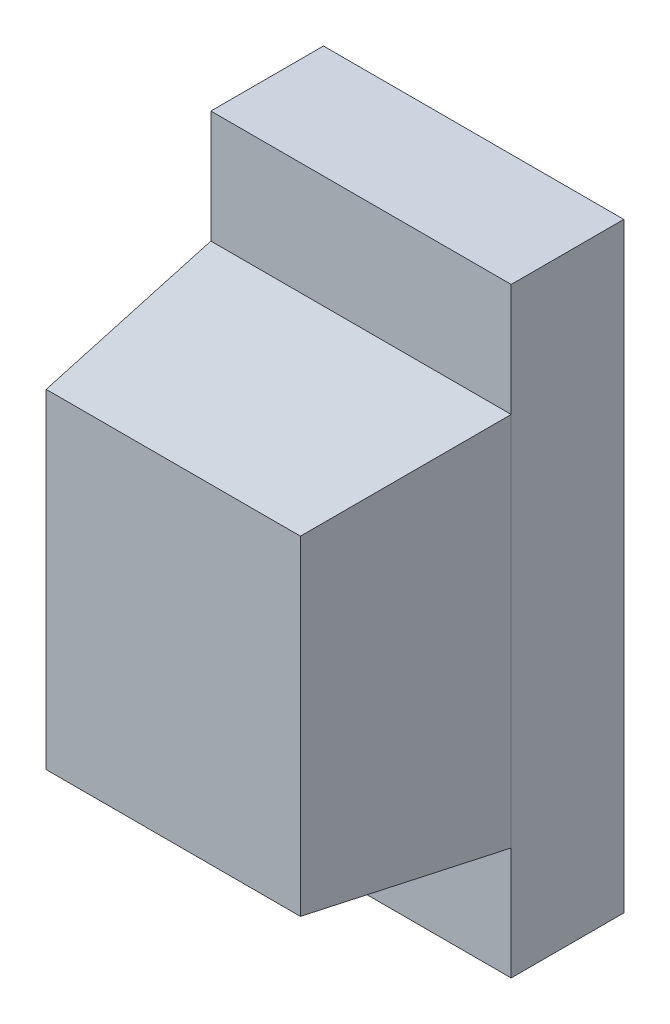
ISO-10303-21;
HEADER;
FILE_DESCRIPTION(('STEP AP214'),'2;1');
FILE_NAME('part.step','',(''),(''),'','','');
FILE_SCHEMA(('AUTOMOTIVE_DESIGN { 1 0 10303 214 1 1 1 1 }'));
ENDSEC;
DATA;
#1=APPLICATION_CONTEXT('core data for automotive mechanical design processes');
#2=APPLICATION_PROTOCOL_DEFINITION('international standard','automotive_design',2000,#1);
#3=PRODUCT_CONTEXT('',#1,'mechanical');
#4=PRODUCT('Part','Part','',(#3));
#5=PRODUCT_RELATED_PRODUCT_CATEGORY('part','',(#4));
#6=PRODUCT_DEFINITION_FORMATION('','',#4);
#7=PRODUCT_DEFINITION_CONTEXT('part definition',#1,'design');
#8=PRODUCT_DEFINITION('design','',#6,#7);
#9=PRODUCT_DEFINITION_SHAPE('','',#8);
#10=(LENGTH_UNIT() NAMED_UNIT(*) SI_UNIT(.MILLI.,.METRE.));
#11=(NAMED_UNIT(*) PLANE_ANGLE_UNIT() SI_UNIT($,.RADIAN.));
#12=(NAMED_UNIT(*) SI_UNIT($,.STERADIAN.) SOLID_ANGLE_UNIT());
#13=UNCERTAINTY_MEASURE_WITH_UNIT(LENGTH_MEASURE(1.E-05),#10,'distance_accuracy_value','');
#14=(GEOMETRIC_REPRESENTATION_CONTEXT(3) GLOBAL_UNCERTAINTY_ASSIGNED_CONTEXT((#13)) GLOBAL_UNIT_ASSIGNED_CONTEXT((#10,
#11,#12)) REPRESENTATION_CONTEXT('',''));
#15=CARTESIAN_POINT('',(0.,0.,0.));
#16=DIRECTION('',(0.,0.,1.));
#17=DIRECTION('',(1.,0.,0.));
#18=AXIS2_PLACEMENT_3D('',#15,#16,#17);
#19=CARTESIAN_POINT('',(0.,0.,0.3));
#20=DIRECTION('',(0.,0.,1.));
#21=DIRECTION('',(1.,0.,0.));
#22=AXIS2_PLACEMENT_3D('',#19,#20,#21);
#23=PLANE('',#22);
#24=DIRECTION('',(1.,0.,0.));
#25=VECTOR('',#24,1.);
#26=CARTESIAN_POINT('',(-0.4,-0.5,0.3));
#27=LINE('',#26,#25);
#28=CARTESIAN_POINT('',(-0.4,-0.5,0.3));
#29=VERTEX_POINT('',#28);
#30=CARTESIAN_POINT('',(0.4,-0.5,0.3));
#31=VERTEX_POINT('',#30);
#32=EDGE_CURVE('E51',#29,#31,#27,.T.);
#33=ORIENTED_EDGE('',*,*,#32,.F.);
#34=DIRECTION('',(0.,-1.,0.));
#35=VECTOR('',#34,1.);
#36=CARTESIAN_POINT('',(-0.4,0.8,0.3));
#37=LINE('',#36,#35);
#38=CARTESIAN_POINT('',(-0.4,-0.8,0.3));
#39=VERTEX_POINT('',#38);
#40=EDGE_CURVE('E148',#29,#39,#37,.T.);
#41=ORIENTED_EDGE('',*,*,#40,.T.);
#42=DIRECTION('',(1.,0.,0.));
#43=VECTOR('',#42,1.);
#44=CARTESIAN_POINT('',(-0.4,-0.8,0.3));
#45=LINE('',#44,#43);
#46=CARTESIAN_POINT('',(0.4,-0.8,0.3));
#47=VERTEX_POINT('',#46);
#48=EDGE_CURVE('E151',#39,#47,#45,.T.);
#49=ORIENTED_EDGE('',*,*,#48,.T.);
#50=DIRECTION('',(0.,1.,0.));
#51=VECTOR('',#50,1.);
#52=CARTESIAN_POINT('',(0.4,0.8,0.3));
#53=LINE('',#52,#51);
#54=EDGE_CURVE('E143',#47,#31,#53,.T.);
#55=ORIENTED_EDGE('',*,*,#54,.T.);
#56=EDGE_LOOP('',(#33,#41,#49,#55));
#57=FACE_BOUND('',#56,.T.);
#58=ADVANCED_FACE('F36',(#57),#23,.T.);
#59=CARTESIAN_POINT('',(0.4,0.8,0.3));
#60=DIRECTION('',(-1.,0.,0.));
#61=DIRECTION('',(0.,-1.,0.));
#62=AXIS2_PLACEMENT_3D('',#59,#60,#61);
#63=PLANE('',#62);
#64=DIRECTION('',(0.,1.,0.));
#65=VECTOR('',#64,1.);
#66=CARTESIAN_POINT('',(0.4,0.8,0.));
#67=LINE('',#66,#65);
#68=CARTESIAN_POINT('',(0.4,-0.8,0.));
#69=VERTEX_POINT('',#68);
#70=CARTESIAN_POINT('',(0.4,0.8,0.));
#71=VERTEX_POINT('',#70);
#72=EDGE_CURVE('E126',#69,#71,#67,.T.);
#73=ORIENTED_EDGE('',*,*,#72,.T.);
#74=DIRECTION('',(0.,0.,-1.));
#75=VECTOR('',#74,1.);
#76=CARTESIAN_POINT('',(0.4,0.8,0.3));
#77=LINE('',#76,#75);
#78=CARTESIAN_POINT('',(0.4,0.8,0.3));
#79=VERTEX_POINT('',#78);
#80=EDGE_CURVE('E12',#79,#71,#77,.T.);
#81=ORIENTED_EDGE('',*,*,#80,.F.);
#82=CARTESIAN_POINT('',(0.4,0.5,0.3));
#83=VERTEX_POINT('',#82);
#84=EDGE_CURVE('E146',#83,#79,#53,.T.);
#85=ORIENTED_EDGE('',*,*,#84,.F.);
#86=DIRECTION('',(0.,1.,0.));
#87=VECTOR('',#86,1.);
#88=CARTESIAN_POINT('',(0.4,-0.5,0.3));
#89=LINE('',#88,#87);
#90=EDGE_CURVE('E133',#31,#83,#89,.T.);
#91=ORIENTED_EDGE('',*,*,#90,.F.);
#92=ORIENTED_EDGE('',*,*,#54,.F.);
#93=DIRECTION('',(0.,0.,-1.));
#94=VECTOR('',#93,1.);
#95=CARTESIAN_POINT('',(0.4,-0.8,0.3));
#96=LINE('',#95,#94);
#97=EDGE_CURVE('E152',#47,#69,#96,.T.);
#98=ORIENTED_EDGE('',*,*,#97,.T.);
#99=EDGE_LOOP('',(#73,#81,#85,#91,#92,#98));
#100=FACE_BOUND('',#99,.T.);
#101=ADVANCED_FACE('F38',(#100),#63,.F.);
#102=CARTESIAN_POINT('',(-0.4,0.8,0.3));
#103=DIRECTION('',(0.,-1.,0.));
#104=DIRECTION('',(0.,0.,-1.));
#105=AXIS2_PLACEMENT_3D('',#102,#103,#104);
#106=PLANE('',#105);
#107=DIRECTION('',(-1.,0.,0.));
#108=VECTOR('',#107,1.);
#109=CARTESIAN_POINT('',(-0.4,0.8,0.));
#110=LINE('',#109,#108);
#111=CARTESIAN_POINT('',(-0.4,0.8,0.));
#112=VERTEX_POINT('',#111);
#113=EDGE_CURVE('E129',#71,#112,#110,.T.);
#114=ORIENTED_EDGE('',*,*,#113,.T.);
#115=DIRECTION('',(0.,0.,-1.));
#116=VECTOR('',#115,1.);
#117=CARTESIAN_POINT('',(-0.4,0.8,0.3));
#118=LINE('',#117,#116);
#119=CARTESIAN_POINT('',(-0.4,0.8,0.3));
#120=VERTEX_POINT('',#119);
#121=EDGE_CURVE('E44',#120,#112,#118,.T.);
#122=ORIENTED_EDGE('',*,*,#121,.F.);
#123=DIRECTION('',(-1.,0.,0.));
#124=VECTOR('',#123,1.);
#125=CARTESIAN_POINT('',(-0.4,0.8,0.3));
#126=LINE('',#125,#124);
#127=EDGE_CURVE('E145',#79,#120,#126,.T.);
#128=ORIENTED_EDGE('',*,*,#127,.F.);
#129=ORIENTED_EDGE('',*,*,#80,.T.);
#130=EDGE_LOOP('',(#114,#122,#128,#129));
#131=FACE_BOUND('',#130,.T.);
#132=ADVANCED_FACE('F205',(#131),#106,.F.);
#133=CARTESIAN_POINT('',(-0.4,0.8,0.3));
#134=DIRECTION('',(1.,0.,0.));
#135=DIRECTION('',(0.,1.,0.));
#136=AXIS2_PLACEMENT_3D('',#133,#134,#135);
#137=PLANE('',#136);
#138=DIRECTION('',(0.,-1.,0.));
#139=VECTOR('',#138,1.);
#140=CARTESIAN_POINT('',(-0.4,0.8,0.));
#141=LINE('',#140,#139);
#142=CARTESIAN_POINT('',(-0.4,-0.8,0.));
#143=VERTEX_POINT('',#142);
#144=EDGE_CURVE('E155',#112,#143,#141,.T.);
#145=ORIENTED_EDGE('',*,*,#144,.T.);
#146=DIRECTION('',(0.,0.,-1.));
#147=VECTOR('',#146,1.);
#148=CARTESIAN_POINT('',(-0.4,-0.8,0.3));
#149=LINE('',#148,#147);
#150=EDGE_CURVE('E161',#39,#143,#149,.T.);
#151=ORIENTED_EDGE('',*,*,#150,.F.);
#152=ORIENTED_EDGE('',*,*,#40,.F.);
#153=DIRECTION('',(0.,-1.,0.));
#154=VECTOR('',#153,1.);
#155=CARTESIAN_POINT('',(-0.4,-0.5,0.3));
#156=LINE('',#155,#154);
#157=CARTESIAN_POINT('',(-0.4,0.5,0.3));
#158=VERTEX_POINT('',#157);
#159=EDGE_CURVE('E110',#158,#29,#156,.T.);
#160=ORIENTED_EDGE('',*,*,#159,.F.);
#161=EDGE_CURVE('E149',#120,#158,#37,.T.);
#162=ORIENTED_EDGE('',*,*,#161,.F.);
#163=ORIENTED_EDGE('',*,*,#121,.T.);
#164=EDGE_LOOP('',(#145,#151,#152,#160,#162,#163));
#165=FACE_BOUND('',#164,.T.);
#166=ADVANCED_FACE('F168',(#165),#137,.F.);
#167=CARTESIAN_POINT('',(-0.4,-0.8,0.3));
#168=DIRECTION('',(0.,1.,0.));
#169=DIRECTION('',(0.,0.,1.));
#170=AXIS2_PLACEMENT_3D('',#167,#168,#169);
#171=PLANE('',#170);
#172=DIRECTION('',(1.,0.,0.));
#173=VECTOR('',#172,1.);
#174=CARTESIAN_POINT('',(-0.4,-0.8,0.));
#175=LINE('',#174,#173);
#176=EDGE_CURVE('E157',#143,#69,#175,.T.);
#177=ORIENTED_EDGE('',*,*,#176,.T.);
#178=ORIENTED_EDGE('',*,*,#97,.F.);
#179=ORIENTED_EDGE('',*,*,#48,.F.);
#180=ORIENTED_EDGE('',*,*,#150,.T.);
#181=EDGE_LOOP('',(#177,#178,#179,#180));
#182=FACE_BOUND('',#181,.T.);
#183=ADVANCED_FACE('F178',(#182),#171,.F.);
#184=DIRECTION('',(-1.,0.,0.));
#185=VECTOR('',#184,1.);
#186=CARTESIAN_POINT('',(-0.4,0.5,0.3));
#187=LINE('',#186,#185);
#188=EDGE_CURVE('E59',#83,#158,#187,.T.);
#189=ORIENTED_EDGE('',*,*,#188,.F.);
#190=ORIENTED_EDGE('',*,*,#84,.T.);
#191=ORIENTED_EDGE('',*,*,#127,.T.);
#192=ORIENTED_EDGE('',*,*,#161,.T.);
#193=EDGE_LOOP('',(#189,#190,#191,#192));
#194=FACE_BOUND('',#193,.T.);
#195=ADVANCED_FACE('F201',(#194),#23,.T.);
#196=CARTESIAN_POINT('',(0.,0.,0.));
#197=DIRECTION('',(0.,0.,1.));
#198=DIRECTION('',(1.,0.,0.));
#199=AXIS2_PLACEMENT_3D('',#196,#197,#198);
#200=PLANE('',#199);
#201=ORIENTED_EDGE('',*,*,#72,.F.);
#202=ORIENTED_EDGE('',*,*,#176,.F.);
#203=ORIENTED_EDGE('',*,*,#144,.F.);
#204=ORIENTED_EDGE('',*,*,#113,.F.);
#205=EDGE_LOOP('',(#201,#202,#203,#204));
#206=FACE_BOUND('',#205,.T.);
#207=ADVANCED_FACE('F175',(#206),#200,.F.);
#208=CARTESIAN_POINT('',(0.4,-0.5,0.3));
#209=DIRECTION('',(0.992546151641322,0.,0.121869343405148));
#210=DIRECTION('',(0.121869343405148,0.,-0.992546151641322));
#211=AXIS2_PLACEMENT_3D('',#208,#209,#210);
#212=PLANE('',#211);
#213=DIRECTION('',(0.,-1.,0.));
#214=VECTOR('',#213,1.);
#215=CARTESIAN_POINT('',(0.338607719548548,-0.5,0.8));
#216=LINE('',#215,#214);
#217=CARTESIAN_POINT('',(0.338607719548548,-0.438607719548548,0.8));
#218=VERTEX_POINT('',#217);
#219=CARTESIAN_POINT('',(0.338607719548548,0.438607719548548,0.8));
#220=VERTEX_POINT('',#219);
#221=EDGE_CURVE('E121',#218,#220,#216,.F.);
#222=ORIENTED_EDGE('',*,*,#221,.F.);
#223=DIRECTION('',(0.120974291151355,-0.120974291151355,-0.985256536015293));
#224=VECTOR('',#223,1.);
#225=CARTESIAN_POINT('',(0.4,-0.5,0.3));
#226=LINE('',#225,#224);
#227=EDGE_CURVE('E117',#218,#31,#226,.T.);
#228=ORIENTED_EDGE('',*,*,#227,.T.);
#229=ORIENTED_EDGE('',*,*,#90,.T.);
#230=DIRECTION('',(0.120974291151355,0.120974291151355,-0.985256536015293));
#231=VECTOR('',#230,1.);
#232=CARTESIAN_POINT('',(0.388292176704342,0.488292176704342,0.395352568837351));
#233=LINE('',#232,#231);
#234=EDGE_CURVE('E137',#220,#83,#233,.T.);
#235=ORIENTED_EDGE('',*,*,#234,.F.);
#236=EDGE_LOOP('',(#222,#228,#229,#235));
#237=FACE_BOUND('',#236,.T.);
#238=ADVANCED_FACE('F185',(#237),#212,.T.);
#239=CARTESIAN_POINT('',(-0.4,0.5,0.3));
#240=DIRECTION('',(0.,0.992546151641322,0.121869343405148));
#241=DIRECTION('',(0.,-0.121869343405148,0.992546151641322));
#242=AXIS2_PLACEMENT_3D('',#239,#240,#241);
#243=PLANE('',#242);
#244=DIRECTION('',(1.,0.,0.));
#245=VECTOR('',#244,1.);
#246=CARTESIAN_POINT('',(-0.4,0.438607719548548,0.8));
#247=LINE('',#246,#245);
#248=CARTESIAN_POINT('',(-0.338607719548548,0.438607719548548,0.8));
#249=VERTEX_POINT('',#248);
#250=EDGE_CURVE('E125',#220,#249,#247,.F.);
#251=ORIENTED_EDGE('',*,*,#250,.F.);
#252=ORIENTED_EDGE('',*,*,#234,.T.);
#253=ORIENTED_EDGE('',*,*,#188,.T.);
#254=DIRECTION('',(-0.120974291151355,0.120974291151355,-0.985256536015293));
#255=VECTOR('',#254,1.);
#256=CARTESIAN_POINT('',(-0.385365220880427,0.485365220880428,0.419190711046689));
#257=LINE('',#256,#255);
#258=EDGE_CURVE('E140',#249,#158,#257,.T.);
#259=ORIENTED_EDGE('',*,*,#258,.F.);
#260=EDGE_LOOP('',(#251,#252,#253,#259));
#261=FACE_BOUND('',#260,.T.);
#262=ADVANCED_FACE('F190',(#261),#243,.T.);
#263=CARTESIAN_POINT('',(-0.4,-0.5,0.3));
#264=DIRECTION('',(-0.992546151641322,0.,0.121869343405148));
#265=DIRECTION('',(0.121869343405148,0.,0.992546151641322));
#266=AXIS2_PLACEMENT_3D('',#263,#264,#265);
#267=PLANE('',#266);
#268=DIRECTION('',(0.,1.,0.));
#269=VECTOR('',#268,1.);
#270=CARTESIAN_POINT('',(-0.338607719548548,-0.5,0.8));
#271=LINE('',#270,#269);
#272=CARTESIAN_POINT('',(-0.338607719548548,-0.438607719548548,0.8));
#273=VERTEX_POINT('',#272);
#274=EDGE_CURVE('E107',#249,#273,#271,.F.);
#275=ORIENTED_EDGE('',*,*,#274,.F.);
#276=ORIENTED_EDGE('',*,*,#258,.T.);
#277=ORIENTED_EDGE('',*,*,#159,.T.);
#278=DIRECTION('',(-0.120974291151355,-0.120974291151355,-0.985256536015293));
#279=VECTOR('',#278,1.);
#280=CARTESIAN_POINT('',(-0.4,-0.5,0.3));
#281=LINE('',#280,#279);
#282=EDGE_CURVE('E102',#273,#29,#281,.T.);
#283=ORIENTED_EDGE('',*,*,#282,.F.);
#284=EDGE_LOOP('',(#275,#276,#277,#283));
#285=FACE_BOUND('',#284,.T.);
#286=ADVANCED_FACE('F104',(#285),#267,.T.);
#287=CARTESIAN_POINT('',(-0.4,-0.5,0.3));
#288=DIRECTION('',(0.,-0.992546151641322,0.121869343405148));
#289=DIRECTION('',(0.,-0.121869343405148,-0.992546151641322));
#290=AXIS2_PLACEMENT_3D('',#287,#288,#289);
#291=PLANE('',#290);
#292=DIRECTION('',(-1.,0.,0.));
#293=VECTOR('',#292,1.);
#294=CARTESIAN_POINT('',(-0.4,-0.438607719548548,0.8));
#295=LINE('',#294,#293);
#296=EDGE_CURVE('E114',#273,#218,#295,.F.);
#297=ORIENTED_EDGE('',*,*,#296,.F.);
#298=ORIENTED_EDGE('',*,*,#282,.T.);
#299=ORIENTED_EDGE('',*,*,#32,.T.);
#300=ORIENTED_EDGE('',*,*,#227,.F.);
#301=EDGE_LOOP('',(#297,#298,#299,#300));
#302=FACE_BOUND('',#301,.T.);
#303=ADVANCED_FACE('F115',(#302),#291,.T.);
#304=CARTESIAN_POINT('',(0.,0.,0.8));
#305=DIRECTION('',(0.,0.,1.));
#306=DIRECTION('',(1.,0.,0.));
#307=AXIS2_PLACEMENT_3D('',#304,#305,#306);
#308=PLANE('',#307);
#309=ORIENTED_EDGE('',*,*,#296,.T.);
#310=ORIENTED_EDGE('',*,*,#221,.T.);
#311=ORIENTED_EDGE('',*,*,#250,.T.);
#312=ORIENTED_EDGE('',*,*,#274,.T.);
#313=EDGE_LOOP('',(#309,#310,#311,#312));
#314=FACE_BOUND('',#313,.T.);
#315=ADVANCED_FACE('F124',(#314),#308,.T.);
#316=CLOSED_SHELL('',(#58,#101,#132,#166,#183,#195,#207,#238,#262,#286,#303,#315));
#317=MANIFOLD_SOLID_BREP('B2',#316);
#318=ADVANCED_BREP_SHAPE_REPRESENTATION('',(#18,#317),#14);
#319=SHAPE_DEFINITION_REPRESENTATION(#9,#318);
ENDSEC;
END-ISO-10303-21;
